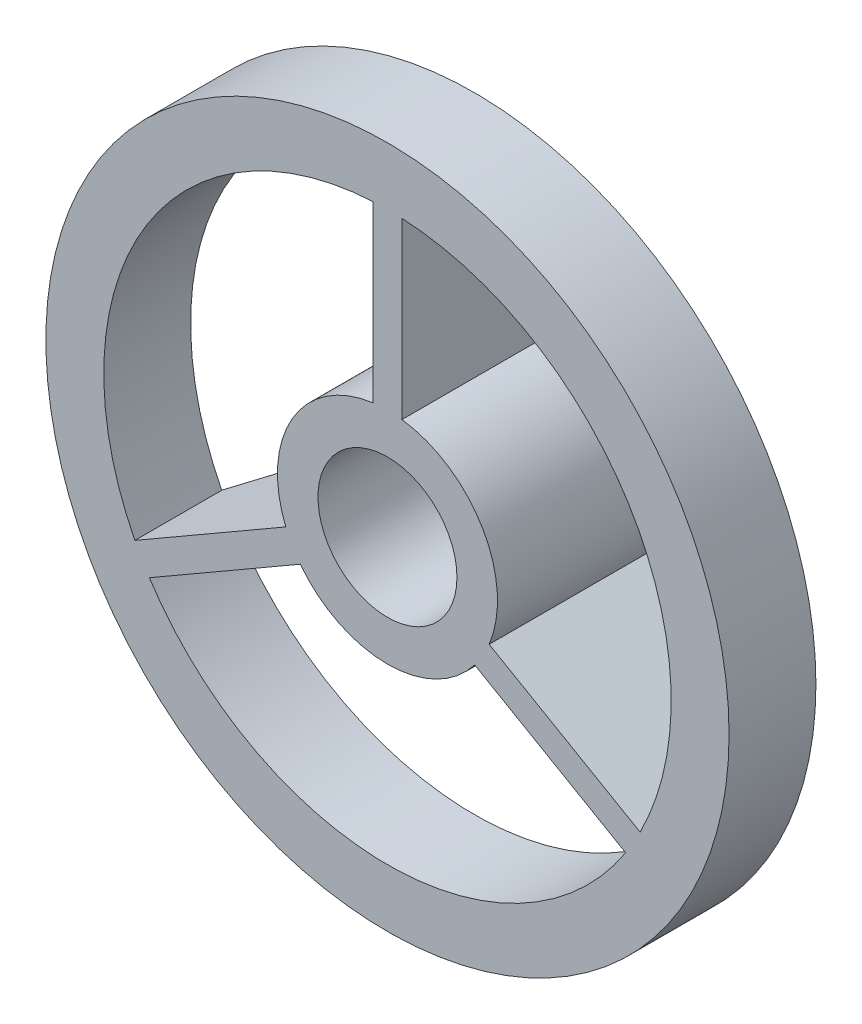
ISO-10303-21;
HEADER;
FILE_DESCRIPTION(('STEP AP214'),'2;1');
FILE_NAME('part.step','',(''),(''),'','','');
FILE_SCHEMA(('AUTOMOTIVE_DESIGN { 1 0 10303 214 1 1 1 1 }'));
ENDSEC;
DATA;
#1=APPLICATION_CONTEXT('core data for automotive mechanical design processes');
#2=APPLICATION_PROTOCOL_DEFINITION('international standard','automotive_design',2000,#1);
#3=PRODUCT_CONTEXT('',#1,'mechanical');
#4=PRODUCT('Part','Part','',(#3));
#5=PRODUCT_RELATED_PRODUCT_CATEGORY('part','',(#4));
#6=PRODUCT_DEFINITION_FORMATION('','',#4);
#7=PRODUCT_DEFINITION_CONTEXT('part definition',#1,'design');
#8=PRODUCT_DEFINITION('design','',#6,#7);
#9=PRODUCT_DEFINITION_SHAPE('','',#8);
#10=(LENGTH_UNIT() NAMED_UNIT(*) SI_UNIT(.MILLI.,.METRE.));
#11=(NAMED_UNIT(*) PLANE_ANGLE_UNIT() SI_UNIT($,.RADIAN.));
#12=(NAMED_UNIT(*) SI_UNIT($,.STERADIAN.) SOLID_ANGLE_UNIT());
#13=UNCERTAINTY_MEASURE_WITH_UNIT(LENGTH_MEASURE(1.E-05),#10,'distance_accuracy_value','');
#14=(GEOMETRIC_REPRESENTATION_CONTEXT(3) GLOBAL_UNCERTAINTY_ASSIGNED_CONTEXT((#13)) GLOBAL_UNIT_ASSIGNED_CONTEXT((#10,
#11,#12)) REPRESENTATION_CONTEXT('',''));
#15=CARTESIAN_POINT('',(0.,0.,0.));
#16=DIRECTION('',(0.,0.,1.));
#17=DIRECTION('',(1.,0.,0.));
#18=AXIS2_PLACEMENT_3D('',#15,#16,#17);
#19=CARTESIAN_POINT('',(0.,0.,2.));
#20=DIRECTION('',(0.,0.,1.));
#21=DIRECTION('',(1.,0.,0.));
#22=AXIS2_PLACEMENT_3D('',#19,#20,#21);
#23=PLANE('',#22);
#24=CARTESIAN_POINT('',(0.,0.,2.));
#25=DIRECTION('',(0.,0.,1.));
#26=DIRECTION('',(1.,0.,0.));
#27=AXIS2_PLACEMENT_3D('',#24,#25,#26);
#28=CIRCLE('',#27,5.9);
#29=CARTESIAN_POINT('',(5.9,0.,2.));
#30=VERTEX_POINT('',#29);
#31=EDGE_CURVE('E276',#30,#30,#28,.T.);
#32=ORIENTED_EDGE('',*,*,#31,.F.);
#33=EDGE_LOOP('',(#32));
#34=FACE_BOUND('',#33,.T.);
#35=DIRECTION('',(-0.866025403784443,0.499999999999992,0.));
#36=VECTOR('',#35,1.);
#37=CARTESIAN_POINT('',(-0.124999999999998,-0.216506350946111,2.));
#38=LINE('',#37,#36);
#39=CARTESIAN_POINT('',(4.11852447854377,-2.66650635094607,2.));
#40=VERTEX_POINT('',#39);
#41=CARTESIAN_POINT('',(4.11299775837602,-2.66331549756949,2.));
#42=VERTEX_POINT('',#41);
#43=EDGE_CURVE('E215',#40,#42,#38,.T.);
#44=ORIENTED_EDGE('',*,*,#43,.F.);
#45=DIRECTION('',(0.499999999999992,0.866025403784443,0.));
#46=VECTOR('',#45,1.);
#47=CARTESIAN_POINT('',(4.11852447854377,-2.66650635094607,2.));
#48=LINE('',#47,#46);
#49=CARTESIAN_POINT('',(4.36852447854377,-2.23349364905385,2.));
#50=VERTEX_POINT('',#49);
#51=EDGE_CURVE('E192',#40,#50,#48,.T.);
#52=ORIENTED_EDGE('',*,*,#51,.T.);
#53=DIRECTION('',(-0.866025403784443,0.499999999999992,0.));
#54=VECTOR('',#53,1.);
#55=CARTESIAN_POINT('',(0.124999999999998,0.216506350946111,2.));
#56=LINE('',#55,#54);
#57=CARTESIAN_POINT('',(4.36299775837602,-2.23030279567726,2.));
#58=VERTEX_POINT('',#57);
#59=EDGE_CURVE('E191',#50,#58,#56,.T.);
#60=ORIENTED_EDGE('',*,*,#59,.T.);
#61=CARTESIAN_POINT('',(0.,0.,2.));
#62=DIRECTION('',(0.,0.,1.));
#63=DIRECTION('',(1.,0.,0.));
#64=AXIS2_PLACEMENT_3D('',#61,#62,#63);
#65=CIRCLE('',#64,4.9);
#66=CARTESIAN_POINT('',(0.25,4.89361829324683,2.));
#67=VERTEX_POINT('',#66);
#68=EDGE_CURVE('E270',#58,#67,#65,.T.);
#69=ORIENTED_EDGE('',*,*,#68,.T.);
#70=DIRECTION('',(0.,1.,0.));
#71=VECTOR('',#70,1.);
#72=CARTESIAN_POINT('',(0.25,0.,2.));
#73=LINE('',#72,#71);
#74=CARTESIAN_POINT('',(0.25,4.9,2.));
#75=VERTEX_POINT('',#74);
#76=EDGE_CURVE('E290',#67,#75,#73,.T.);
#77=ORIENTED_EDGE('',*,*,#76,.T.);
#78=DIRECTION('',(-1.,0.,0.));
#79=VECTOR('',#78,1.);
#80=CARTESIAN_POINT('',(0.25,4.9,2.));
#81=LINE('',#80,#79);
#82=CARTESIAN_POINT('',(-0.25,4.9,2.));
#83=VERTEX_POINT('',#82);
#84=EDGE_CURVE('E310',#75,#83,#81,.T.);
#85=ORIENTED_EDGE('',*,*,#84,.T.);
#86=DIRECTION('',(0.,1.,0.));
#87=VECTOR('',#86,1.);
#88=CARTESIAN_POINT('',(-0.25,0.,2.));
#89=LINE('',#88,#87);
#90=CARTESIAN_POINT('',(-0.25,4.89361829324683,2.));
#91=VERTEX_POINT('',#90);
#92=EDGE_CURVE('E294',#91,#83,#89,.T.);
#93=ORIENTED_EDGE('',*,*,#92,.F.);
#94=CARTESIAN_POINT('',(-4.36299775837599,-2.23030279567732,2.));
#95=VERTEX_POINT('',#94);
#96=EDGE_CURVE('E264',#91,#95,#65,.T.);
#97=ORIENTED_EDGE('',*,*,#96,.T.);
#98=DIRECTION('',(0.866025403784436,0.500000000000004,0.));
#99=VECTOR('',#98,1.);
#100=CARTESIAN_POINT('',(-0.125000000000001,0.216506350946109,2.));
#101=LINE('',#100,#99);
#102=CARTESIAN_POINT('',(-4.36852447854374,-2.23349364905391,2.));
#103=VERTEX_POINT('',#102);
#104=EDGE_CURVE('E257',#103,#95,#101,.T.);
#105=ORIENTED_EDGE('',*,*,#104,.F.);
#106=DIRECTION('',(0.500000000000004,-0.866025403784436,0.));
#107=VECTOR('',#106,1.);
#108=CARTESIAN_POINT('',(-4.36852447854374,-2.23349364905391,2.));
#109=LINE('',#108,#107);
#110=CARTESIAN_POINT('',(-4.11852447854374,-2.66650635094613,2.));
#111=VERTEX_POINT('',#110);
#112=EDGE_CURVE('E232',#103,#111,#109,.T.);
#113=ORIENTED_EDGE('',*,*,#112,.T.);
#114=DIRECTION('',(0.866025403784436,0.500000000000004,0.));
#115=VECTOR('',#114,1.);
#116=CARTESIAN_POINT('',(0.125000000000001,-0.216506350946109,2.));
#117=LINE('',#116,#115);
#118=CARTESIAN_POINT('',(-4.11299775837599,-2.66331549756954,2.));
#119=VERTEX_POINT('',#118);
#120=EDGE_CURVE('E249',#111,#119,#117,.T.);
#121=ORIENTED_EDGE('',*,*,#120,.T.);
#122=EDGE_CURVE('E269',#119,#42,#65,.T.);
#123=ORIENTED_EDGE('',*,*,#122,.T.);
#124=EDGE_LOOP('',(#44,#52,#60,#69,#77,#85,#93,#97,#105,#113,#121,#123));
#125=FACE_BOUND('',#124,.T.);
#126=ADVANCED_FACE('F45',(#34,#125),#23,.F.);
#127=CARTESIAN_POINT('',(0.,0.,3.5));
#128=DIRECTION('',(0.,0.,-1.));
#129=DIRECTION('',(-1.,0.,0.));
#130=AXIS2_PLACEMENT_3D('',#127,#128,#129);
#131=CYLINDRICAL_SURFACE('',#130,1.9);
#132=DIRECTION('',(0.,0.,-1.));
#133=VECTOR('',#132,1.);
#134=CARTESIAN_POINT('',(1.50614223781988,-1.15824676103796,3.5));
#135=LINE('',#134,#133);
#136=CARTESIAN_POINT('',(1.50614223781988,-1.15824676103796,3.5));
#137=VERTEX_POINT('',#136);
#138=CARTESIAN_POINT('',(1.50614223781988,-1.15824676103796,0.));
#139=VERTEX_POINT('',#138);
#140=EDGE_CURVE('E177',#137,#139,#135,.T.);
#141=ORIENTED_EDGE('',*,*,#140,.F.);
#142=CARTESIAN_POINT('',(0.,0.,3.5));
#143=DIRECTION('',(0.,0.,1.));
#144=DIRECTION('',(1.,0.,0.));
#145=AXIS2_PLACEMENT_3D('',#142,#143,#144);
#146=CIRCLE('',#145,1.9);
#147=CARTESIAN_POINT('',(-1.50614223781986,-1.15824676103798,3.5));
#148=VERTEX_POINT('',#147);
#149=EDGE_CURVE('E339',#148,#137,#146,.T.);
#150=ORIENTED_EDGE('',*,*,#149,.F.);
#151=DIRECTION('',(0.,0.,-1.));
#152=VECTOR('',#151,1.);
#153=CARTESIAN_POINT('',(-1.50614223781986,-1.15824676103798,3.5));
#154=LINE('',#153,#152);
#155=CARTESIAN_POINT('',(-1.50614223781986,-1.15824676103798,0.));
#156=VERTEX_POINT('',#155);
#157=EDGE_CURVE('E253',#148,#156,#154,.T.);
#158=ORIENTED_EDGE('',*,*,#157,.T.);
#159=CARTESIAN_POINT('',(0.,0.,0.));
#160=DIRECTION('',(0.,0.,1.));
#161=DIRECTION('',(1.,0.,0.));
#162=AXIS2_PLACEMENT_3D('',#159,#160,#161);
#163=CIRCLE('',#162,1.9);
#164=EDGE_CURVE('E345',#156,#139,#163,.T.);
#165=ORIENTED_EDGE('',*,*,#164,.T.);
#166=EDGE_LOOP('',(#141,#150,#158,#165));
#167=FACE_BOUND('',#166,.T.);
#168=ADVANCED_FACE('F385',(#167),#131,.T.);
#169=CARTESIAN_POINT('',(0.,0.,2.));
#170=DIRECTION('',(0.,0.,1.));
#171=DIRECTION('',(1.,0.,0.));
#172=AXIS2_PLACEMENT_3D('',#169,#170,#171);
#173=CYLINDRICAL_SURFACE('',#172,4.9);
#174=DIRECTION('',(0.,0.,1.));
#175=VECTOR('',#174,1.);
#176=CARTESIAN_POINT('',(4.11299775837602,-2.66331549756949,2.));
#177=LINE('',#176,#175);
#178=CARTESIAN_POINT('',(4.11299775837602,-2.66331549756949,3.5));
#179=VERTEX_POINT('',#178);
#180=EDGE_CURVE('E11',#42,#179,#177,.T.);
#181=ORIENTED_EDGE('',*,*,#180,.F.);
#182=ORIENTED_EDGE('',*,*,#122,.F.);
#183=DIRECTION('',(0.,0.,1.));
#184=VECTOR('',#183,1.);
#185=CARTESIAN_POINT('',(-4.11299775837599,-2.66331549756954,2.));
#186=LINE('',#185,#184);
#187=CARTESIAN_POINT('',(-4.11299775837599,-2.66331549756954,3.5));
#188=VERTEX_POINT('',#187);
#189=EDGE_CURVE('E353',#119,#188,#186,.T.);
#190=ORIENTED_EDGE('',*,*,#189,.T.);
#191=CARTESIAN_POINT('',(0.,0.,3.5));
#192=DIRECTION('',(0.,0.,1.));
#193=DIRECTION('',(1.,0.,0.));
#194=AXIS2_PLACEMENT_3D('',#191,#192,#193);
#195=CIRCLE('',#194,4.9);
#196=EDGE_CURVE('E275',#188,#179,#195,.T.);
#197=ORIENTED_EDGE('',*,*,#196,.T.);
#198=EDGE_LOOP('',(#181,#182,#190,#197));
#199=FACE_BOUND('',#198,.T.);
#200=ADVANCED_FACE('F376',(#199),#173,.F.);
#201=DIRECTION('',(0.,0.,-1.));
#202=VECTOR('',#201,1.);
#203=CARTESIAN_POINT('',(-1.75614223781986,-0.725234059145767,3.5));
#204=LINE('',#203,#202);
#205=CARTESIAN_POINT('',(-1.75614223781986,-0.725234059145766,3.5));
#206=VERTEX_POINT('',#205);
#207=CARTESIAN_POINT('',(-1.75614223781986,-0.725234059145766,0.));
#208=VERTEX_POINT('',#207);
#209=EDGE_CURVE('E260',#206,#208,#204,.T.);
#210=ORIENTED_EDGE('',*,*,#209,.F.);
#211=CARTESIAN_POINT('',(-0.25,1.88348082018374,3.5));
#212=VERTEX_POINT('',#211);
#213=EDGE_CURVE('E334',#212,#206,#146,.T.);
#214=ORIENTED_EDGE('',*,*,#213,.F.);
#215=DIRECTION('',(0.,0.,-1.));
#216=VECTOR('',#215,1.);
#217=CARTESIAN_POINT('',(-0.25,1.88348082018374,3.5));
#218=LINE('',#217,#216);
#219=CARTESIAN_POINT('',(-0.25,1.88348082018374,0.));
#220=VERTEX_POINT('',#219);
#221=EDGE_CURVE('E338',#212,#220,#218,.T.);
#222=ORIENTED_EDGE('',*,*,#221,.T.);
#223=EDGE_CURVE('E341',#220,#208,#163,.T.);
#224=ORIENTED_EDGE('',*,*,#223,.T.);
#225=EDGE_LOOP('',(#210,#214,#222,#224));
#226=FACE_BOUND('',#225,.T.);
#227=ADVANCED_FACE('F417',(#226),#131,.T.);
#228=DIRECTION('',(0.,0.,1.));
#229=VECTOR('',#228,1.);
#230=CARTESIAN_POINT('',(-4.36299775837599,-2.23030279567732,2.));
#231=LINE('',#230,#229);
#232=CARTESIAN_POINT('',(-4.36299775837599,-2.23030279567733,3.5));
#233=VERTEX_POINT('',#232);
#234=EDGE_CURVE('E357',#95,#233,#231,.T.);
#235=ORIENTED_EDGE('',*,*,#234,.F.);
#236=ORIENTED_EDGE('',*,*,#96,.F.);
#237=DIRECTION('',(0.,0.,1.));
#238=VECTOR('',#237,1.);
#239=CARTESIAN_POINT('',(-0.25,4.89361829324683,2.));
#240=LINE('',#239,#238);
#241=CARTESIAN_POINT('',(-0.25,4.89361829324683,3.5));
#242=VERTEX_POINT('',#241);
#243=EDGE_CURVE('E280',#242,#91,#240,.F.);
#244=ORIENTED_EDGE('',*,*,#243,.F.);
#245=EDGE_CURVE('E271',#242,#233,#195,.T.);
#246=ORIENTED_EDGE('',*,*,#245,.T.);
#247=EDGE_LOOP('',(#235,#236,#244,#246));
#248=FACE_BOUND('',#247,.T.);
#249=ADVANCED_FACE('F426',(#248),#173,.F.);
#250=CARTESIAN_POINT('',(0.25,0.,0.));
#251=DIRECTION('',(-1.,0.,0.));
#252=DIRECTION('',(0.,0.,1.));
#253=AXIS2_PLACEMENT_3D('',#250,#251,#252);
#254=PLANE('',#253);
#255=ORIENTED_EDGE('',*,*,#76,.F.);
#256=DIRECTION('',(0.,0.,1.));
#257=VECTOR('',#256,1.);
#258=CARTESIAN_POINT('',(0.25,4.89361829324683,2.));
#259=LINE('',#258,#257);
#260=CARTESIAN_POINT('',(0.25,4.89361829324683,3.5));
#261=VERTEX_POINT('',#260);
#262=EDGE_CURVE('E286',#261,#67,#259,.F.);
#263=ORIENTED_EDGE('',*,*,#262,.F.);
#264=DIRECTION('',(0.,-1.,0.));
#265=VECTOR('',#264,1.);
#266=CARTESIAN_POINT('',(0.25,1.9,3.5));
#267=LINE('',#266,#265);
#268=CARTESIAN_POINT('',(0.25,1.88348082018374,3.5));
#269=VERTEX_POINT('',#268);
#270=EDGE_CURVE('E299',#261,#269,#267,.T.);
#271=ORIENTED_EDGE('',*,*,#270,.T.);
#272=DIRECTION('',(0.,0.,-1.));
#273=VECTOR('',#272,1.);
#274=CARTESIAN_POINT('',(0.25,1.88348082018374,3.5));
#275=LINE('',#274,#273);
#276=CARTESIAN_POINT('',(0.25,1.88348082018374,0.));
#277=VERTEX_POINT('',#276);
#278=EDGE_CURVE('E349',#269,#277,#275,.T.);
#279=ORIENTED_EDGE('',*,*,#278,.T.);
#280=DIRECTION('',(0.,1.,0.));
#281=VECTOR('',#280,1.);
#282=CARTESIAN_POINT('',(0.25,1.9,0.));
#283=LINE('',#282,#281);
#284=CARTESIAN_POINT('',(0.25,1.9,0.));
#285=VERTEX_POINT('',#284);
#286=EDGE_CURVE('E303',#277,#285,#283,.T.);
#287=ORIENTED_EDGE('',*,*,#286,.T.);
#288=DIRECTION('',(0.,0.832050294337844,0.554700196225229));
#289=VECTOR('',#288,1.);
#290=CARTESIAN_POINT('',(0.25,4.9,2.));
#291=LINE('',#290,#289);
#292=EDGE_CURVE('E307',#285,#75,#291,.T.);
#293=ORIENTED_EDGE('',*,*,#292,.T.);
#294=EDGE_LOOP('',(#255,#263,#271,#279,#287,#293));
#295=FACE_BOUND('',#294,.T.);
#296=ADVANCED_FACE('F393',(#295),#254,.F.);
#297=CARTESIAN_POINT('',(-0.25,0.,0.));
#298=DIRECTION('',(-1.,0.,0.));
#299=DIRECTION('',(0.,0.,1.));
#300=AXIS2_PLACEMENT_3D('',#297,#298,#299);
#301=PLANE('',#300);
#302=ORIENTED_EDGE('',*,*,#243,.T.);
#303=ORIENTED_EDGE('',*,*,#92,.T.);
#304=DIRECTION('',(0.,0.832050294337844,0.554700196225229));
#305=VECTOR('',#304,1.);
#306=CARTESIAN_POINT('',(-0.25,4.9,2.));
#307=LINE('',#306,#305);
#308=CARTESIAN_POINT('',(-0.25,1.9,0.));
#309=VERTEX_POINT('',#308);
#310=EDGE_CURVE('E304',#309,#83,#307,.T.);
#311=ORIENTED_EDGE('',*,*,#310,.F.);
#312=DIRECTION('',(0.,1.,0.));
#313=VECTOR('',#312,1.);
#314=CARTESIAN_POINT('',(-0.25,1.9,0.));
#315=LINE('',#314,#313);
#316=EDGE_CURVE('E313',#220,#309,#315,.T.);
#317=ORIENTED_EDGE('',*,*,#316,.F.);
#318=ORIENTED_EDGE('',*,*,#221,.F.);
#319=DIRECTION('',(0.,-1.,0.));
#320=VECTOR('',#319,1.);
#321=CARTESIAN_POINT('',(-0.25,1.9,3.5));
#322=LINE('',#321,#320);
#323=EDGE_CURVE('E298',#242,#212,#322,.T.);
#324=ORIENTED_EDGE('',*,*,#323,.F.);
#325=EDGE_LOOP('',(#302,#303,#311,#317,#318,#324));
#326=FACE_BOUND('',#325,.T.);
#327=ADVANCED_FACE('F421',(#326),#301,.T.);
#328=CARTESIAN_POINT('',(1.75614223781987,-0.725234059145742,3.5));
#329=VERTEX_POINT('',#328);
#330=EDGE_CURVE('E340',#329,#269,#146,.T.);
#331=ORIENTED_EDGE('',*,*,#330,.F.);
#332=DIRECTION('',(0.,0.,-1.));
#333=VECTOR('',#332,1.);
#334=CARTESIAN_POINT('',(1.75614223781987,-0.725234059145742,3.5));
#335=LINE('',#334,#333);
#336=CARTESIAN_POINT('',(1.75614223781987,-0.725234059145742,0.));
#337=VERTEX_POINT('',#336);
#338=EDGE_CURVE('E212',#329,#337,#335,.T.);
#339=ORIENTED_EDGE('',*,*,#338,.T.);
#340=EDGE_CURVE('E330',#337,#277,#163,.T.);
#341=ORIENTED_EDGE('',*,*,#340,.T.);
#342=ORIENTED_EDGE('',*,*,#278,.F.);
#343=EDGE_LOOP('',(#331,#339,#341,#342));
#344=FACE_BOUND('',#343,.T.);
#345=ADVANCED_FACE('F47',(#344),#131,.T.);
#346=CARTESIAN_POINT('',(0.,0.,3.5));
#347=DIRECTION('',(0.,0.,1.));
#348=DIRECTION('',(1.,0.,0.));
#349=AXIS2_PLACEMENT_3D('',#346,#347,#348);
#350=PLANE('',#349);
#351=ORIENTED_EDGE('',*,*,#149,.T.);
#352=DIRECTION('',(-0.866025403784443,0.499999999999992,0.));
#353=VECTOR('',#352,1.);
#354=CARTESIAN_POINT('',(1.52044826719044,-1.1665063509461,3.5));
#355=LINE('',#354,#353);
#356=EDGE_CURVE('E182',#179,#137,#355,.T.);
#357=ORIENTED_EDGE('',*,*,#356,.F.);
#358=ORIENTED_EDGE('',*,*,#196,.F.);
#359=DIRECTION('',(0.866025403784436,0.500000000000004,0.));
#360=VECTOR('',#359,1.);
#361=CARTESIAN_POINT('',(-1.52044826719043,-1.16650635094612,3.5));
#362=LINE('',#361,#360);
#363=EDGE_CURVE('E220',#188,#148,#362,.T.);
#364=ORIENTED_EDGE('',*,*,#363,.T.);
#365=EDGE_LOOP('',(#351,#357,#358,#364));
#366=FACE_BOUND('',#365,.T.);
#367=DIRECTION('',(-0.866025403784443,0.499999999999992,0.));
#368=VECTOR('',#367,1.);
#369=CARTESIAN_POINT('',(1.77044826719044,-0.733493649053874,3.5));
#370=LINE('',#369,#368);
#371=CARTESIAN_POINT('',(4.36299775837602,-2.23030279567726,3.5));
#372=VERTEX_POINT('',#371);
#373=EDGE_CURVE('E67',#372,#329,#370,.T.);
#374=ORIENTED_EDGE('',*,*,#373,.T.);
#375=ORIENTED_EDGE('',*,*,#330,.T.);
#376=ORIENTED_EDGE('',*,*,#270,.F.);
#377=EDGE_CURVE('E263',#372,#261,#195,.T.);
#378=ORIENTED_EDGE('',*,*,#377,.F.);
#379=EDGE_LOOP('',(#374,#375,#376,#378));
#380=FACE_BOUND('',#379,.T.);
#381=ORIENTED_EDGE('',*,*,#213,.T.);
#382=DIRECTION('',(0.866025403784436,0.500000000000004,0.));
#383=VECTOR('',#382,1.);
#384=CARTESIAN_POINT('',(-1.77044826719043,-0.733493649053898,3.5));
#385=LINE('',#384,#383);
#386=EDGE_CURVE('E221',#233,#206,#385,.T.);
#387=ORIENTED_EDGE('',*,*,#386,.F.);
#388=ORIENTED_EDGE('',*,*,#245,.F.);
#389=ORIENTED_EDGE('',*,*,#323,.T.);
#390=EDGE_LOOP('',(#381,#387,#388,#389));
#391=FACE_BOUND('',#390,.T.);
#392=CARTESIAN_POINT('',(0.,0.,3.5));
#393=DIRECTION('',(0.,0.,1.));
#394=DIRECTION('',(1.,0.,0.));
#395=AXIS2_PLACEMENT_3D('',#392,#393,#394);
#396=CIRCLE('',#395,5.9);
#397=CARTESIAN_POINT('',(5.9,0.,3.5));
#398=VERTEX_POINT('',#397);
#399=EDGE_CURVE('E268',#398,#398,#396,.T.);
#400=ORIENTED_EDGE('',*,*,#399,.T.);
#401=EDGE_LOOP('',(#400));
#402=FACE_BOUND('',#401,.T.);
#403=CARTESIAN_POINT('',(0.,0.,3.5));
#404=DIRECTION('',(0.,0.,1.));
#405=DIRECTION('',(1.,0.,0.));
#406=AXIS2_PLACEMENT_3D('',#403,#404,#405);
#407=CIRCLE('',#406,1.2);
#408=CARTESIAN_POINT('',(1.2,0.,3.5));
#409=VERTEX_POINT('',#408);
#410=EDGE_CURVE('E326',#409,#409,#407,.T.);
#411=ORIENTED_EDGE('',*,*,#410,.F.);
#412=EDGE_LOOP('',(#411));
#413=FACE_BOUND('',#412,.T.);
#414=ADVANCED_FACE('F367',(#366,#380,#391,#402,#413),#350,.T.);
#415=CARTESIAN_POINT('',(0.,0.,0.));
#416=DIRECTION('',(0.,0.,1.));
#417=DIRECTION('',(1.,0.,0.));
#418=AXIS2_PLACEMENT_3D('',#415,#416,#417);
#419=PLANE('',#418);
#420=DIRECTION('',(0.866025403784443,-0.499999999999992,0.));
#421=VECTOR('',#420,1.);
#422=CARTESIAN_POINT('',(1.77044826719044,-0.733493649053874,0.));
#423=LINE('',#422,#421);
#424=CARTESIAN_POINT('',(1.77044826719044,-0.733493649053874,0.));
#425=VERTEX_POINT('',#424);
#426=EDGE_CURVE('E61',#337,#425,#423,.T.);
#427=ORIENTED_EDGE('',*,*,#426,.T.);
#428=DIRECTION('',(0.499999999999992,0.866025403784443,0.));
#429=VECTOR('',#428,1.);
#430=CARTESIAN_POINT('',(1.52044826719044,-1.1665063509461,0.));
#431=LINE('',#430,#429);
#432=CARTESIAN_POINT('',(1.52044826719044,-1.1665063509461,0.));
#433=VERTEX_POINT('',#432);
#434=EDGE_CURVE('E184',#433,#425,#431,.T.);
#435=ORIENTED_EDGE('',*,*,#434,.F.);
#436=DIRECTION('',(0.866025403784443,-0.499999999999992,0.));
#437=VECTOR('',#436,1.);
#438=CARTESIAN_POINT('',(1.52044826719044,-1.1665063509461,0.));
#439=LINE('',#438,#437);
#440=EDGE_CURVE('E170',#139,#433,#439,.T.);
#441=ORIENTED_EDGE('',*,*,#440,.F.);
#442=ORIENTED_EDGE('',*,*,#164,.F.);
#443=DIRECTION('',(-0.866025403784436,-0.500000000000004,0.));
#444=VECTOR('',#443,1.);
#445=CARTESIAN_POINT('',(-1.52044826719043,-1.16650635094612,0.));
#446=LINE('',#445,#444);
#447=CARTESIAN_POINT('',(-1.52044826719043,-1.16650635094612,0.));
#448=VERTEX_POINT('',#447);
#449=EDGE_CURVE('E236',#156,#448,#446,.T.);
#450=ORIENTED_EDGE('',*,*,#449,.T.);
#451=DIRECTION('',(0.500000000000004,-0.866025403784436,0.));
#452=VECTOR('',#451,1.);
#453=CARTESIAN_POINT('',(-1.77044826719043,-0.733493649053898,0.));
#454=LINE('',#453,#452);
#455=CARTESIAN_POINT('',(-1.77044826719043,-0.733493649053898,0.));
#456=VERTEX_POINT('',#455);
#457=EDGE_CURVE('E246',#456,#448,#454,.T.);
#458=ORIENTED_EDGE('',*,*,#457,.F.);
#459=DIRECTION('',(-0.866025403784436,-0.500000000000004,0.));
#460=VECTOR('',#459,1.);
#461=CARTESIAN_POINT('',(-1.77044826719043,-0.733493649053898,0.));
#462=LINE('',#461,#460);
#463=EDGE_CURVE('E224',#208,#456,#462,.T.);
#464=ORIENTED_EDGE('',*,*,#463,.F.);
#465=ORIENTED_EDGE('',*,*,#223,.F.);
#466=ORIENTED_EDGE('',*,*,#316,.T.);
#467=DIRECTION('',(-1.,0.,0.));
#468=VECTOR('',#467,1.);
#469=CARTESIAN_POINT('',(0.25,1.9,0.));
#470=LINE('',#469,#468);
#471=EDGE_CURVE('E322',#285,#309,#470,.T.);
#472=ORIENTED_EDGE('',*,*,#471,.F.);
#473=ORIENTED_EDGE('',*,*,#286,.F.);
#474=ORIENTED_EDGE('',*,*,#340,.F.);
#475=EDGE_LOOP('',(#427,#435,#441,#442,#450,#458,#464,#465,#466,#472,#473,#474));
#476=FACE_BOUND('',#475,.T.);
#477=CARTESIAN_POINT('',(0.,0.,0.));
#478=DIRECTION('',(0.,0.,1.));
#479=DIRECTION('',(1.,0.,0.));
#480=AXIS2_PLACEMENT_3D('',#477,#478,#479);
#481=CIRCLE('',#480,1.2);
#482=CARTESIAN_POINT('',(1.2,0.,0.));
#483=VERTEX_POINT('',#482);
#484=EDGE_CURVE('E325',#483,#483,#481,.T.);
#485=ORIENTED_EDGE('',*,*,#484,.T.);
#486=EDGE_LOOP('',(#485));
#487=FACE_BOUND('',#486,.T.);
#488=ADVANCED_FACE('F185',(#476,#487),#419,.F.);
#489=CARTESIAN_POINT('',(0.,0.,3.5));
#490=DIRECTION('',(0.,0.,-1.));
#491=DIRECTION('',(-1.,0.,0.));
#492=AXIS2_PLACEMENT_3D('',#489,#490,#491);
#493=CYLINDRICAL_SURFACE('',#492,1.2);
#494=ORIENTED_EDGE('',*,*,#410,.T.);
#495=EDGE_LOOP('',(#494));
#496=FACE_BOUND('',#495,.T.);
#497=ORIENTED_EDGE('',*,*,#484,.F.);
#498=EDGE_LOOP('',(#497));
#499=FACE_BOUND('',#498,.T.);
#500=ADVANCED_FACE('F437',(#496,#499),#493,.F.);
#501=CARTESIAN_POINT('',(0.25,4.9,2.));
#502=DIRECTION('',(0.,-0.554700196225229,0.832050294337844));
#503=DIRECTION('',(0.,-0.832050294337844,-0.554700196225229));
#504=AXIS2_PLACEMENT_3D('',#501,#502,#503);
#505=PLANE('',#504);
#506=ORIENTED_EDGE('',*,*,#310,.T.);
#507=ORIENTED_EDGE('',*,*,#84,.F.);
#508=ORIENTED_EDGE('',*,*,#292,.F.);
#509=ORIENTED_EDGE('',*,*,#471,.T.);
#510=EDGE_LOOP('',(#506,#507,#508,#509));
#511=FACE_BOUND('',#510,.T.);
#512=ADVANCED_FACE('F400',(#511),#505,.F.);
#513=ORIENTED_EDGE('',*,*,#68,.F.);
#514=DIRECTION('',(0.,0.,1.));
#515=VECTOR('',#514,1.);
#516=CARTESIAN_POINT('',(4.36299775837602,-2.23030279567726,2.));
#517=LINE('',#516,#515);
#518=EDGE_CURVE('E54',#58,#372,#517,.T.);
#519=ORIENTED_EDGE('',*,*,#518,.T.);
#520=ORIENTED_EDGE('',*,*,#377,.T.);
#521=ORIENTED_EDGE('',*,*,#262,.T.);
#522=EDGE_LOOP('',(#513,#519,#520,#521));
#523=FACE_BOUND('',#522,.T.);
#524=ADVANCED_FACE('F363',(#523),#173,.F.);
#525=CARTESIAN_POINT('',(0.,0.,2.));
#526=DIRECTION('',(0.,0.,1.));
#527=DIRECTION('',(1.,0.,0.));
#528=AXIS2_PLACEMENT_3D('',#525,#526,#527);
#529=CYLINDRICAL_SURFACE('',#528,5.9);
#530=ORIENTED_EDGE('',*,*,#31,.T.);
#531=EDGE_LOOP('',(#530));
#532=FACE_BOUND('',#531,.T.);
#533=ORIENTED_EDGE('',*,*,#399,.F.);
#534=EDGE_LOOP('',(#533));
#535=FACE_BOUND('',#534,.T.);
#536=ADVANCED_FACE('F455',(#532,#535),#529,.T.);
#537=CARTESIAN_POINT('',(-0.125000000000001,0.216506350946109,0.));
#538=DIRECTION('',(0.500000000000004,-0.866025403784436,0.));
#539=DIRECTION('',(0.,0.,1.));
#540=AXIS2_PLACEMENT_3D('',#537,#538,#539);
#541=PLANE('',#540);
#542=ORIENTED_EDGE('',*,*,#386,.T.);
#543=ORIENTED_EDGE('',*,*,#209,.T.);
#544=ORIENTED_EDGE('',*,*,#463,.T.);
#545=DIRECTION('',(-0.72057669212289,-0.416025147168925,0.554700196225229));
#546=VECTOR('',#545,1.);
#547=CARTESIAN_POINT('',(-4.36852447854374,-2.23349364905391,2.));
#548=LINE('',#547,#546);
#549=EDGE_CURVE('E228',#456,#103,#548,.T.);
#550=ORIENTED_EDGE('',*,*,#549,.T.);
#551=ORIENTED_EDGE('',*,*,#104,.T.);
#552=ORIENTED_EDGE('',*,*,#234,.T.);
#553=EDGE_LOOP('',(#542,#543,#544,#550,#551,#552));
#554=FACE_BOUND('',#553,.T.);
#555=ADVANCED_FACE('F429',(#554),#541,.F.);
#556=CARTESIAN_POINT('',(0.125000000000001,-0.216506350946109,0.));
#557=DIRECTION('',(0.500000000000004,-0.866025403784436,0.));
#558=DIRECTION('',(0.,0.,1.));
#559=AXIS2_PLACEMENT_3D('',#556,#557,#558);
#560=PLANE('',#559);
#561=ORIENTED_EDGE('',*,*,#157,.F.);
#562=ORIENTED_EDGE('',*,*,#363,.F.);
#563=ORIENTED_EDGE('',*,*,#189,.F.);
#564=ORIENTED_EDGE('',*,*,#120,.F.);
#565=DIRECTION('',(-0.72057669212289,-0.416025147168925,0.554700196225229));
#566=VECTOR('',#565,1.);
#567=CARTESIAN_POINT('',(-4.11852447854374,-2.66650635094613,2.));
#568=LINE('',#567,#566);
#569=EDGE_CURVE('E225',#448,#111,#568,.T.);
#570=ORIENTED_EDGE('',*,*,#569,.F.);
#571=ORIENTED_EDGE('',*,*,#449,.F.);
#572=EDGE_LOOP('',(#561,#562,#563,#564,#570,#571));
#573=FACE_BOUND('',#572,.T.);
#574=ADVANCED_FACE('F408',(#573),#560,.T.);
#575=CARTESIAN_POINT('',(-4.36852447854374,-2.23349364905391,2.));
#576=DIRECTION('',(0.48038446141526,0.277350098112617,0.832050294337844));
#577=DIRECTION('',(0.866025403784439,0.,-0.499999999999999));
#578=AXIS2_PLACEMENT_3D('',#575,#576,#577);
#579=PLANE('',#578);
#580=ORIENTED_EDGE('',*,*,#569,.T.);
#581=ORIENTED_EDGE('',*,*,#112,.F.);
#582=ORIENTED_EDGE('',*,*,#549,.F.);
#583=ORIENTED_EDGE('',*,*,#457,.T.);
#584=EDGE_LOOP('',(#580,#581,#582,#583));
#585=FACE_BOUND('',#584,.T.);
#586=ADVANCED_FACE('F410',(#585),#579,.F.);
#587=CARTESIAN_POINT('',(-0.124999999999998,-0.216506350946111,0.));
#588=DIRECTION('',(0.499999999999992,0.866025403784443,0.));
#589=DIRECTION('',(0.,0.,1.));
#590=AXIS2_PLACEMENT_3D('',#587,#588,#589);
#591=PLANE('',#590);
#592=ORIENTED_EDGE('',*,*,#356,.T.);
#593=ORIENTED_EDGE('',*,*,#140,.T.);
#594=ORIENTED_EDGE('',*,*,#440,.T.);
#595=DIRECTION('',(0.720576692122896,-0.416025147168915,0.554700196225229));
#596=VECTOR('',#595,1.);
#597=CARTESIAN_POINT('',(4.11852447854377,-2.66650635094607,2.));
#598=LINE('',#597,#596);
#599=EDGE_CURVE('E174',#433,#40,#598,.T.);
#600=ORIENTED_EDGE('',*,*,#599,.T.);
#601=ORIENTED_EDGE('',*,*,#43,.T.);
#602=ORIENTED_EDGE('',*,*,#180,.T.);
#603=EDGE_LOOP('',(#592,#593,#594,#600,#601,#602));
#604=FACE_BOUND('',#603,.T.);
#605=ADVANCED_FACE('F172',(#604),#591,.F.);
#606=CARTESIAN_POINT('',(0.124999999999998,0.216506350946111,0.));
#607=DIRECTION('',(0.499999999999992,0.866025403784443,0.));
#608=DIRECTION('',(0.,0.,1.));
#609=AXIS2_PLACEMENT_3D('',#606,#607,#608);
#610=PLANE('',#609);
#611=ORIENTED_EDGE('',*,*,#338,.F.);
#612=ORIENTED_EDGE('',*,*,#373,.F.);
#613=ORIENTED_EDGE('',*,*,#518,.F.);
#614=ORIENTED_EDGE('',*,*,#59,.F.);
#615=DIRECTION('',(0.720576692122896,-0.416025147168915,0.554700196225229));
#616=VECTOR('',#615,1.);
#617=CARTESIAN_POINT('',(4.36852447854377,-2.23349364905385,2.));
#618=LINE('',#617,#616);
#619=EDGE_CURVE('E206',#425,#50,#618,.T.);
#620=ORIENTED_EDGE('',*,*,#619,.F.);
#621=ORIENTED_EDGE('',*,*,#426,.F.);
#622=EDGE_LOOP('',(#611,#612,#613,#614,#620,#621));
#623=FACE_BOUND('',#622,.T.);
#624=ADVANCED_FACE('F537',(#623),#610,.T.);
#625=CARTESIAN_POINT('',(4.11852447854377,-2.66650635094607,2.));
#626=DIRECTION('',(-0.480384461415264,0.27735009811261,0.832050294337844));
#627=DIRECTION('',(0.866025403784437,0.,0.500000000000002));
#628=AXIS2_PLACEMENT_3D('',#625,#626,#627);
#629=PLANE('',#628);
#630=ORIENTED_EDGE('',*,*,#619,.T.);
#631=ORIENTED_EDGE('',*,*,#51,.F.);
#632=ORIENTED_EDGE('',*,*,#599,.F.);
#633=ORIENTED_EDGE('',*,*,#434,.T.);
#634=EDGE_LOOP('',(#630,#631,#632,#633));
#635=FACE_BOUND('',#634,.T.);
#636=ADVANCED_FACE('F194',(#635),#629,.F.);
#637=CLOSED_SHELL('',(#126,#168,#200,#227,#249,#296,#327,#345,#414,#488,#500,#512,#524,#536,
#555,#574,#586,#605,#624,#636));
#638=MANIFOLD_SOLID_BREP('B2',#637);
#639=ADVANCED_BREP_SHAPE_REPRESENTATION('',(#18,#638),#14);
#640=SHAPE_DEFINITION_REPRESENTATION(#9,#639);
ENDSEC;
END-ISO-10303-21;
